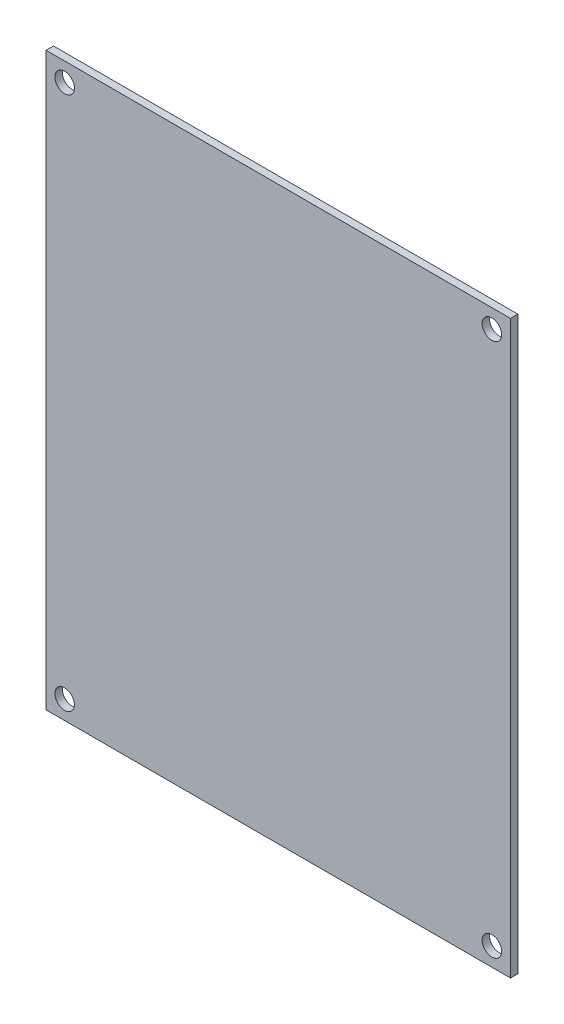
ISO-10303-21;
HEADER;
FILE_DESCRIPTION(('STEP AP214'),'2;1');
FILE_NAME('part.step','',(''),(''),'','','');
FILE_SCHEMA(('AUTOMOTIVE_DESIGN { 1 0 10303 214 1 1 1 1 }'));
ENDSEC;
DATA;
#1=APPLICATION_CONTEXT('core data for automotive mechanical design processes');
#2=APPLICATION_PROTOCOL_DEFINITION('international standard','automotive_design',2000,#1);
#3=PRODUCT_CONTEXT('',#1,'mechanical');
#4=PRODUCT('Part','Part','',(#3));
#5=PRODUCT_RELATED_PRODUCT_CATEGORY('part','',(#4));
#6=PRODUCT_DEFINITION_FORMATION('','',#4);
#7=PRODUCT_DEFINITION_CONTEXT('part definition',#1,'design');
#8=PRODUCT_DEFINITION('design','',#6,#7);
#9=PRODUCT_DEFINITION_SHAPE('','',#8);
#10=(LENGTH_UNIT() NAMED_UNIT(*) SI_UNIT(.MILLI.,.METRE.));
#11=(NAMED_UNIT(*) PLANE_ANGLE_UNIT() SI_UNIT($,.RADIAN.));
#12=(NAMED_UNIT(*) SI_UNIT($,.STERADIAN.) SOLID_ANGLE_UNIT());
#13=UNCERTAINTY_MEASURE_WITH_UNIT(LENGTH_MEASURE(1.E-05),#10,'distance_accuracy_value','');
#14=(GEOMETRIC_REPRESENTATION_CONTEXT(3) GLOBAL_UNCERTAINTY_ASSIGNED_CONTEXT((#13)) GLOBAL_UNIT_ASSIGNED_CONTEXT((#10,
#11,#12)) REPRESENTATION_CONTEXT('',''));
#15=CARTESIAN_POINT('',(0.,0.,0.));
#16=DIRECTION('',(0.,0.,1.));
#17=DIRECTION('',(1.,0.,0.));
#18=AXIS2_PLACEMENT_3D('',#15,#16,#17);
#19=CARTESIAN_POINT('',(0.,0.,1.6));
#20=DIRECTION('',(0.,0.,1.));
#21=DIRECTION('',(1.,0.,0.));
#22=AXIS2_PLACEMENT_3D('',#19,#20,#21);
#23=PLANE('',#22);
#24=CARTESIAN_POINT('',(100.1668405,36.181495,1.6));
#25=DIRECTION('',(0.,0.,1.));
#26=DIRECTION('',(1.,0.,0.));
#27=AXIS2_PLACEMENT_3D('',#24,#25,#26);
#28=CIRCLE('',#27,2.1);
#29=CARTESIAN_POINT('',(102.2668405,36.181495,1.6));
#30=VERTEX_POINT('',#29);
#31=EDGE_CURVE('E126',#30,#30,#28,.T.);
#32=ORIENTED_EDGE('',*,*,#31,.F.);
#33=EDGE_LOOP('',(#32));
#34=FACE_BOUND('',#33,.T.);
#35=CARTESIAN_POINT('',(8.16763175000002,151.18016,1.6));
#36=DIRECTION('',(0.,0.,1.));
#37=DIRECTION('',(1.,0.,0.));
#38=AXIS2_PLACEMENT_3D('',#35,#36,#37);
#39=CIRCLE('',#38,2.1);
#40=CARTESIAN_POINT('',(10.26763175,151.18016,1.6));
#41=VERTEX_POINT('',#40);
#42=EDGE_CURVE('E104',#41,#41,#39,.T.);
#43=ORIENTED_EDGE('',*,*,#42,.F.);
#44=EDGE_LOOP('',(#43));
#45=FACE_BOUND('',#44,.T.);
#46=DIRECTION('',(0.,1.,0.));
#47=VECTOR('',#46,1.);
#48=CARTESIAN_POINT('',(104.16728925,32.18105,1.6));
#49=LINE('',#48,#47);
#50=CARTESIAN_POINT('',(104.16728925,32.18105,1.6));
#51=VERTEX_POINT('',#50);
#52=CARTESIAN_POINT('',(104.16728925,155.1806075,1.6));
#53=VERTEX_POINT('',#52);
#54=EDGE_CURVE('E88',#51,#53,#49,.T.);
#55=ORIENTED_EDGE('',*,*,#54,.T.);
#56=DIRECTION('',(-1.,0.,0.));
#57=VECTOR('',#56,1.);
#58=CARTESIAN_POINT('',(104.16728925,155.1806075,1.6));
#59=LINE('',#58,#57);
#60=CARTESIAN_POINT('',(4.16718800000002,155.1806075,1.6));
#61=VERTEX_POINT('',#60);
#62=EDGE_CURVE('E83',#53,#61,#59,.T.);
#63=ORIENTED_EDGE('',*,*,#62,.T.);
#64=DIRECTION('',(0.,-1.,0.));
#65=VECTOR('',#64,1.);
#66=CARTESIAN_POINT('',(4.16718800000002,32.18105,1.6));
#67=LINE('',#66,#65);
#68=CARTESIAN_POINT('',(4.16718800000002,32.18105,1.6));
#69=VERTEX_POINT('',#68);
#70=EDGE_CURVE('E86',#61,#69,#67,.T.);
#71=ORIENTED_EDGE('',*,*,#70,.T.);
#72=DIRECTION('',(1.,0.,0.));
#73=VECTOR('',#72,1.);
#74=CARTESIAN_POINT('',(104.16728925,32.18105,1.6));
#75=LINE('',#74,#73);
#76=EDGE_CURVE('E53',#69,#51,#75,.T.);
#77=ORIENTED_EDGE('',*,*,#76,.T.);
#78=EDGE_LOOP('',(#55,#63,#71,#77));
#79=FACE_BOUND('',#78,.T.);
#80=CARTESIAN_POINT('',(100.1668405,151.18016,1.6));
#81=DIRECTION('',(0.,0.,1.));
#82=DIRECTION('',(1.,0.,0.));
#83=AXIS2_PLACEMENT_3D('',#80,#81,#82);
#84=CIRCLE('',#83,2.1);
#85=CARTESIAN_POINT('',(102.2668405,151.18016,1.6));
#86=VERTEX_POINT('',#85);
#87=EDGE_CURVE('E120',#86,#86,#84,.T.);
#88=ORIENTED_EDGE('',*,*,#87,.F.);
#89=EDGE_LOOP('',(#88));
#90=FACE_BOUND('',#89,.T.);
#91=CARTESIAN_POINT('',(8.16763175000002,36.181495625,1.6));
#92=DIRECTION('',(0.,0.,1.));
#93=DIRECTION('',(1.,0.,0.));
#94=AXIS2_PLACEMENT_3D('',#91,#92,#93);
#95=CIRCLE('',#94,2.1);
#96=CARTESIAN_POINT('',(10.26763175,36.181495625,1.6));
#97=VERTEX_POINT('',#96);
#98=EDGE_CURVE('E132',#97,#97,#95,.T.);
#99=ORIENTED_EDGE('',*,*,#98,.F.);
#100=EDGE_LOOP('',(#99));
#101=FACE_BOUND('',#100,.T.);
#102=ADVANCED_FACE('F36',(#34,#45,#79,#90,#101),#23,.T.);
#103=CARTESIAN_POINT('',(0.,0.,0.));
#104=DIRECTION('',(0.,0.,1.));
#105=DIRECTION('',(1.,0.,0.));
#106=AXIS2_PLACEMENT_3D('',#103,#104,#105);
#107=PLANE('',#106);
#108=CARTESIAN_POINT('',(100.1668405,36.181495,0.));
#109=DIRECTION('',(0.,0.,1.));
#110=DIRECTION('',(1.,0.,0.));
#111=AXIS2_PLACEMENT_3D('',#108,#109,#110);
#112=CIRCLE('',#111,2.1);
#113=CARTESIAN_POINT('',(102.2668405,36.181495,0.));
#114=VERTEX_POINT('',#113);
#115=EDGE_CURVE('E129',#114,#114,#112,.T.);
#116=ORIENTED_EDGE('',*,*,#115,.T.);
#117=EDGE_LOOP('',(#116));
#118=FACE_BOUND('',#117,.T.);
#119=CARTESIAN_POINT('',(8.16763175000002,151.18016,0.));
#120=DIRECTION('',(0.,0.,1.));
#121=DIRECTION('',(1.,0.,0.));
#122=AXIS2_PLACEMENT_3D('',#119,#120,#121);
#123=CIRCLE('',#122,2.1);
#124=CARTESIAN_POINT('',(10.26763175,151.18016,0.));
#125=VERTEX_POINT('',#124);
#126=EDGE_CURVE('E117',#125,#125,#123,.T.);
#127=ORIENTED_EDGE('',*,*,#126,.T.);
#128=EDGE_LOOP('',(#127));
#129=FACE_BOUND('',#128,.T.);
#130=DIRECTION('',(0.,1.,0.));
#131=VECTOR('',#130,1.);
#132=CARTESIAN_POINT('',(104.16728925,32.18105,0.));
#133=LINE('',#132,#131);
#134=CARTESIAN_POINT('',(104.16728925,32.18105,0.));
#135=VERTEX_POINT('',#134);
#136=CARTESIAN_POINT('',(104.16728925,155.1806075,0.));
#137=VERTEX_POINT('',#136);
#138=EDGE_CURVE('E100',#135,#137,#133,.T.);
#139=ORIENTED_EDGE('',*,*,#138,.F.);
#140=DIRECTION('',(1.,0.,0.));
#141=VECTOR('',#140,1.);
#142=CARTESIAN_POINT('',(104.16728925,32.18105,0.));
#143=LINE('',#142,#141);
#144=CARTESIAN_POINT('',(4.16718800000002,32.18105,0.));
#145=VERTEX_POINT('',#144);
#146=EDGE_CURVE('E76',#145,#135,#143,.T.);
#147=ORIENTED_EDGE('',*,*,#146,.F.);
#148=DIRECTION('',(0.,-1.,0.));
#149=VECTOR('',#148,1.);
#150=CARTESIAN_POINT('',(4.16718800000002,32.18105,0.));
#151=LINE('',#150,#149);
#152=CARTESIAN_POINT('',(4.16718800000002,155.1806075,0.));
#153=VERTEX_POINT('',#152);
#154=EDGE_CURVE('E70',#153,#145,#151,.T.);
#155=ORIENTED_EDGE('',*,*,#154,.F.);
#156=DIRECTION('',(-1.,0.,0.));
#157=VECTOR('',#156,1.);
#158=CARTESIAN_POINT('',(104.16728925,155.1806075,0.));
#159=LINE('',#158,#157);
#160=EDGE_CURVE('E92',#137,#153,#159,.T.);
#161=ORIENTED_EDGE('',*,*,#160,.F.);
#162=EDGE_LOOP('',(#139,#147,#155,#161));
#163=FACE_BOUND('',#162,.T.);
#164=CARTESIAN_POINT('',(100.1668405,151.18016,0.));
#165=DIRECTION('',(0.,0.,1.));
#166=DIRECTION('',(1.,0.,0.));
#167=AXIS2_PLACEMENT_3D('',#164,#165,#166);
#168=CIRCLE('',#167,2.1);
#169=CARTESIAN_POINT('',(102.2668405,151.18016,0.));
#170=VERTEX_POINT('',#169);
#171=EDGE_CURVE('E123',#170,#170,#168,.T.);
#172=ORIENTED_EDGE('',*,*,#171,.T.);
#173=EDGE_LOOP('',(#172));
#174=FACE_BOUND('',#173,.T.);
#175=CARTESIAN_POINT('',(8.16763175000002,36.181495625,0.));
#176=DIRECTION('',(0.,0.,1.));
#177=DIRECTION('',(1.,0.,0.));
#178=AXIS2_PLACEMENT_3D('',#175,#176,#177);
#179=CIRCLE('',#178,2.1);
#180=CARTESIAN_POINT('',(10.26763175,36.181495625,0.));
#181=VERTEX_POINT('',#180);
#182=EDGE_CURVE('E135',#181,#181,#179,.T.);
#183=ORIENTED_EDGE('',*,*,#182,.T.);
#184=EDGE_LOOP('',(#183));
#185=FACE_BOUND('',#184,.T.);
#186=ADVANCED_FACE('F112',(#118,#129,#163,#174,#185),#107,.F.);
#187=CARTESIAN_POINT('',(104.16728925,32.18105,1.6));
#188=DIRECTION('',(-1.,0.,0.));
#189=DIRECTION('',(0.,0.,1.));
#190=AXIS2_PLACEMENT_3D('',#187,#188,#189);
#191=PLANE('',#190);
#192=ORIENTED_EDGE('',*,*,#138,.T.);
#193=DIRECTION('',(0.,0.,-1.));
#194=VECTOR('',#193,1.);
#195=CARTESIAN_POINT('',(104.16728925,155.1806075,1.6));
#196=LINE('',#195,#194);
#197=EDGE_CURVE('E11',#53,#137,#196,.T.);
#198=ORIENTED_EDGE('',*,*,#197,.F.);
#199=ORIENTED_EDGE('',*,*,#54,.F.);
#200=DIRECTION('',(0.,0.,-1.));
#201=VECTOR('',#200,1.);
#202=CARTESIAN_POINT('',(104.16728925,32.18105,1.6));
#203=LINE('',#202,#201);
#204=EDGE_CURVE('E96',#51,#135,#203,.T.);
#205=ORIENTED_EDGE('',*,*,#204,.T.);
#206=EDGE_LOOP('',(#192,#198,#199,#205));
#207=FACE_BOUND('',#206,.T.);
#208=ADVANCED_FACE('F38',(#207),#191,.F.);
#209=CARTESIAN_POINT('',(104.16728925,155.1806075,1.6));
#210=DIRECTION('',(0.,-1.,0.));
#211=DIRECTION('',(0.,0.,-1.));
#212=AXIS2_PLACEMENT_3D('',#209,#210,#211);
#213=PLANE('',#212);
#214=ORIENTED_EDGE('',*,*,#160,.T.);
#215=DIRECTION('',(0.,0.,-1.));
#216=VECTOR('',#215,1.);
#217=CARTESIAN_POINT('',(4.16718800000002,155.1806075,1.6));
#218=LINE('',#217,#216);
#219=EDGE_CURVE('E45',#61,#153,#218,.T.);
#220=ORIENTED_EDGE('',*,*,#219,.F.);
#221=ORIENTED_EDGE('',*,*,#62,.F.);
#222=ORIENTED_EDGE('',*,*,#197,.T.);
#223=EDGE_LOOP('',(#214,#220,#221,#222));
#224=FACE_BOUND('',#223,.T.);
#225=ADVANCED_FACE('F91',(#224),#213,.F.);
#226=CARTESIAN_POINT('',(4.16718800000002,32.18105,1.6));
#227=DIRECTION('',(1.,0.,0.));
#228=DIRECTION('',(0.,0.,-1.));
#229=AXIS2_PLACEMENT_3D('',#226,#227,#228);
#230=PLANE('',#229);
#231=ORIENTED_EDGE('',*,*,#154,.T.);
#232=DIRECTION('',(0.,0.,-1.));
#233=VECTOR('',#232,1.);
#234=CARTESIAN_POINT('',(4.16718800000002,32.18105,1.6));
#235=LINE('',#234,#233);
#236=EDGE_CURVE('E93',#69,#145,#235,.T.);
#237=ORIENTED_EDGE('',*,*,#236,.F.);
#238=ORIENTED_EDGE('',*,*,#70,.F.);
#239=ORIENTED_EDGE('',*,*,#219,.T.);
#240=EDGE_LOOP('',(#231,#237,#238,#239));
#241=FACE_BOUND('',#240,.T.);
#242=ADVANCED_FACE('F94',(#241),#230,.F.);
#243=CARTESIAN_POINT('',(104.16728925,32.18105,1.6));
#244=DIRECTION('',(0.,1.,0.));
#245=DIRECTION('',(0.,0.,1.));
#246=AXIS2_PLACEMENT_3D('',#243,#244,#245);
#247=PLANE('',#246);
#248=ORIENTED_EDGE('',*,*,#146,.T.);
#249=ORIENTED_EDGE('',*,*,#204,.F.);
#250=ORIENTED_EDGE('',*,*,#76,.F.);
#251=ORIENTED_EDGE('',*,*,#236,.T.);
#252=EDGE_LOOP('',(#248,#249,#250,#251));
#253=FACE_BOUND('',#252,.T.);
#254=ADVANCED_FACE('F109',(#253),#247,.F.);
#255=CARTESIAN_POINT('',(8.16763175000002,151.18016,1.6));
#256=DIRECTION('',(0.,0.,-1.));
#257=DIRECTION('',(-1.,0.,0.));
#258=AXIS2_PLACEMENT_3D('',#255,#256,#257);
#259=CYLINDRICAL_SURFACE('',#258,2.1);
#260=ORIENTED_EDGE('',*,*,#42,.T.);
#261=EDGE_LOOP('',(#260));
#262=FACE_BOUND('',#261,.T.);
#263=ORIENTED_EDGE('',*,*,#126,.F.);
#264=EDGE_LOOP('',(#263));
#265=FACE_BOUND('',#264,.T.);
#266=ADVANCED_FACE('F155',(#262,#265),#259,.F.);
#267=CARTESIAN_POINT('',(100.1668405,151.18016,1.6));
#268=DIRECTION('',(0.,0.,-1.));
#269=DIRECTION('',(-1.,0.,0.));
#270=AXIS2_PLACEMENT_3D('',#267,#268,#269);
#271=CYLINDRICAL_SURFACE('',#270,2.1);
#272=ORIENTED_EDGE('',*,*,#87,.T.);
#273=EDGE_LOOP('',(#272));
#274=FACE_BOUND('',#273,.T.);
#275=ORIENTED_EDGE('',*,*,#171,.F.);
#276=EDGE_LOOP('',(#275));
#277=FACE_BOUND('',#276,.T.);
#278=ADVANCED_FACE('F203',(#274,#277),#271,.F.);
#279=CARTESIAN_POINT('',(100.1668405,36.181495,1.6));
#280=DIRECTION('',(0.,0.,-1.));
#281=DIRECTION('',(-1.,0.,0.));
#282=AXIS2_PLACEMENT_3D('',#279,#280,#281);
#283=CYLINDRICAL_SURFACE('',#282,2.1);
#284=ORIENTED_EDGE('',*,*,#31,.T.);
#285=EDGE_LOOP('',(#284));
#286=FACE_BOUND('',#285,.T.);
#287=ORIENTED_EDGE('',*,*,#115,.F.);
#288=EDGE_LOOP('',(#287));
#289=FACE_BOUND('',#288,.T.);
#290=ADVANCED_FACE('F211',(#286,#289),#283,.F.);
#291=CARTESIAN_POINT('',(8.16763175000002,36.181495625,1.6));
#292=DIRECTION('',(0.,0.,-1.));
#293=DIRECTION('',(-1.,0.,0.));
#294=AXIS2_PLACEMENT_3D('',#291,#292,#293);
#295=CYLINDRICAL_SURFACE('',#294,2.1);
#296=ORIENTED_EDGE('',*,*,#98,.T.);
#297=EDGE_LOOP('',(#296));
#298=FACE_BOUND('',#297,.T.);
#299=ORIENTED_EDGE('',*,*,#182,.F.);
#300=EDGE_LOOP('',(#299));
#301=FACE_BOUND('',#300,.T.);
#302=ADVANCED_FACE('F141',(#298,#301),#295,.F.);
#303=CLOSED_SHELL('',(#102,#186,#208,#225,#242,#254,#266,#278,#290,#302));
#304=MANIFOLD_SOLID_BREP('B2',#303);
#305=ADVANCED_BREP_SHAPE_REPRESENTATION('',(#18,#304),#14);
#306=SHAPE_DEFINITION_REPRESENTATION(#9,#305);
ENDSEC;
END-ISO-10303-21;
